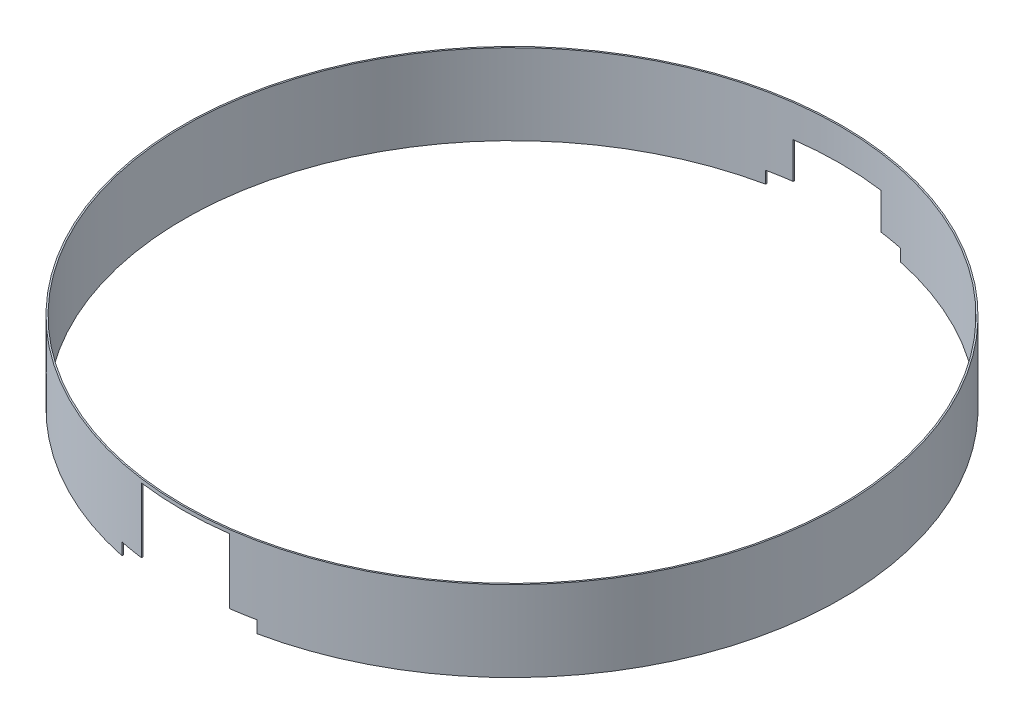
ISO-10303-21;
HEADER;
FILE_DESCRIPTION(('STEP AP214'),'2;1');
FILE_NAME('part.step','',(''),(''),'','','');
FILE_SCHEMA(('AUTOMOTIVE_DESIGN { 1 0 10303 214 1 1 1 1 }'));
ENDSEC;
DATA;
#1=APPLICATION_CONTEXT('core data for automotive mechanical design processes');
#2=APPLICATION_PROTOCOL_DEFINITION('international standard','automotive_design',2000,#1);
#3=PRODUCT_CONTEXT('',#1,'mechanical');
#4=PRODUCT('Part','Part','',(#3));
#5=PRODUCT_RELATED_PRODUCT_CATEGORY('part','',(#4));
#6=PRODUCT_DEFINITION_FORMATION('','',#4);
#7=PRODUCT_DEFINITION_CONTEXT('part definition',#1,'design');
#8=PRODUCT_DEFINITION('design','',#6,#7);
#9=PRODUCT_DEFINITION_SHAPE('','',#8);
#10=(LENGTH_UNIT() NAMED_UNIT(*) SI_UNIT(.MILLI.,.METRE.));
#11=(NAMED_UNIT(*) PLANE_ANGLE_UNIT() SI_UNIT($,.RADIAN.));
#12=(NAMED_UNIT(*) SI_UNIT($,.STERADIAN.) SOLID_ANGLE_UNIT());
#13=UNCERTAINTY_MEASURE_WITH_UNIT(LENGTH_MEASURE(1.E-05),#10,'distance_accuracy_value','');
#14=(GEOMETRIC_REPRESENTATION_CONTEXT(3) GLOBAL_UNCERTAINTY_ASSIGNED_CONTEXT((#13)) GLOBAL_UNIT_ASSIGNED_CONTEXT((#10,
#11,#12)) REPRESENTATION_CONTEXT('',''));
#15=CARTESIAN_POINT('',(0.,0.,0.));
#16=DIRECTION('',(0.,0.,1.));
#17=DIRECTION('',(1.,0.,0.));
#18=AXIS2_PLACEMENT_3D('',#15,#16,#17);
#19=CARTESIAN_POINT('',(0.,0.,0.));
#20=DIRECTION('',(0.,1.,0.));
#21=DIRECTION('',(0.,0.,1.));
#22=AXIS2_PLACEMENT_3D('',#19,#20,#21);
#23=PLANE('',#22);
#24=DIRECTION('',(0.,0.,1.));
#25=VECTOR('',#24,1.);
#26=CARTESIAN_POINT('',(-92.,0.,-500.));
#27=LINE('',#26,#25);
#28=CARTESIAN_POINT('',(-92.,0.,-440.495175910021));
#29=VERTEX_POINT('',#28);
#30=CARTESIAN_POINT('',(-92.,0.,-438.451821754683));
#31=VERTEX_POINT('',#30);
#32=EDGE_CURVE('E282',#29,#31,#27,.T.);
#33=ORIENTED_EDGE('',*,*,#32,.T.);
#34=CARTESIAN_POINT('',(0.,0.,0.));
#35=DIRECTION('',(0.,1.,0.));
#36=DIRECTION('',(0.,0.,1.));
#37=AXIS2_PLACEMENT_3D('',#34,#35,#36);
#38=CIRCLE('',#37,448.);
#39=CARTESIAN_POINT('',(-92.,0.,438.451821754683));
#40=VERTEX_POINT('',#39);
#41=EDGE_CURVE('E214',#31,#40,#38,.T.);
#42=ORIENTED_EDGE('',*,*,#41,.T.);
#43=DIRECTION('',(0.,0.,-1.));
#44=VECTOR('',#43,1.);
#45=CARTESIAN_POINT('',(-92.,0.,500.));
#46=LINE('',#45,#44);
#47=CARTESIAN_POINT('',(-92.,0.,440.495175910021));
#48=VERTEX_POINT('',#47);
#49=EDGE_CURVE('E178',#48,#40,#46,.T.);
#50=ORIENTED_EDGE('',*,*,#49,.F.);
#51=CARTESIAN_POINT('',(0.,0.,0.));
#52=DIRECTION('',(0.,1.,0.));
#53=DIRECTION('',(0.,0.,1.));
#54=AXIS2_PLACEMENT_3D('',#51,#52,#53);
#55=CIRCLE('',#54,450.);
#56=EDGE_CURVE('E218',#29,#48,#55,.T.);
#57=ORIENTED_EDGE('',*,*,#56,.F.);
#58=EDGE_LOOP('',(#33,#42,#50,#57));
#59=FACE_BOUND('',#58,.T.);
#60=ADVANCED_FACE('F35',(#59),#23,.F.);
#61=CARTESIAN_POINT('',(92.,0.,438.451821754683));
#62=VERTEX_POINT('',#61);
#63=CARTESIAN_POINT('',(92.,0.,-438.451821754683));
#64=VERTEX_POINT('',#63);
#65=EDGE_CURVE('E219',#62,#64,#38,.T.);
#66=ORIENTED_EDGE('',*,*,#65,.T.);
#67=DIRECTION('',(0.,0.,1.));
#68=VECTOR('',#67,1.);
#69=CARTESIAN_POINT('',(92.,0.,-500.));
#70=LINE('',#69,#68);
#71=CARTESIAN_POINT('',(92.,0.,-440.495175910021));
#72=VERTEX_POINT('',#71);
#73=EDGE_CURVE('E277',#72,#64,#70,.T.);
#74=ORIENTED_EDGE('',*,*,#73,.F.);
#75=CARTESIAN_POINT('',(92.,0.,440.495175910021));
#76=VERTEX_POINT('',#75);
#77=EDGE_CURVE('E226',#76,#72,#55,.T.);
#78=ORIENTED_EDGE('',*,*,#77,.F.);
#79=DIRECTION('',(0.,0.,-1.));
#80=VECTOR('',#79,1.);
#81=CARTESIAN_POINT('',(92.,0.,500.));
#82=LINE('',#81,#80);
#83=EDGE_CURVE('E172',#76,#62,#82,.T.);
#84=ORIENTED_EDGE('',*,*,#83,.T.);
#85=EDGE_LOOP('',(#66,#74,#78,#84));
#86=FACE_BOUND('',#85,.T.);
#87=ADVANCED_FACE('F296',(#86),#23,.F.);
#88=CARTESIAN_POINT('',(0.,110.,0.));
#89=DIRECTION('',(0.,1.,0.));
#90=DIRECTION('',(0.,0.,1.));
#91=AXIS2_PLACEMENT_3D('',#88,#89,#90);
#92=PLANE('',#91);
#93=CARTESIAN_POINT('',(0.,110.,0.));
#94=DIRECTION('',(0.,1.,0.));
#95=DIRECTION('',(0.,0.,1.));
#96=AXIS2_PLACEMENT_3D('',#93,#94,#95);
#97=CIRCLE('',#96,450.);
#98=CARTESIAN_POINT('',(0.,110.,450.));
#99=VERTEX_POINT('',#98);
#100=EDGE_CURVE('E222',#99,#99,#97,.T.);
#101=ORIENTED_EDGE('',*,*,#100,.T.);
#102=EDGE_LOOP('',(#101));
#103=FACE_BOUND('',#102,.T.);
#104=CARTESIAN_POINT('',(0.,110.,0.));
#105=DIRECTION('',(0.,1.,0.));
#106=DIRECTION('',(0.,0.,1.));
#107=AXIS2_PLACEMENT_3D('',#104,#105,#106);
#108=CIRCLE('',#107,448.);
#109=CARTESIAN_POINT('',(0.,110.,448.));
#110=VERTEX_POINT('',#109);
#111=EDGE_CURVE('E215',#110,#110,#108,.T.);
#112=ORIENTED_EDGE('',*,*,#111,.F.);
#113=EDGE_LOOP('',(#112));
#114=FACE_BOUND('',#113,.T.);
#115=ADVANCED_FACE('F343',(#103,#114),#92,.T.);
#116=CARTESIAN_POINT('',(0.,110.,0.));
#117=DIRECTION('',(0.,-1.,0.));
#118=DIRECTION('',(0.,0.,-1.));
#119=AXIS2_PLACEMENT_3D('',#116,#117,#118);
#120=CYLINDRICAL_SURFACE('',#119,450.);
#121=ORIENTED_EDGE('',*,*,#100,.F.);
#122=EDGE_LOOP('',(#121));
#123=FACE_BOUND('',#122,.T.);
#124=ORIENTED_EDGE('',*,*,#77,.T.);
#125=DIRECTION('',(0.,-1.,0.));
#126=VECTOR('',#125,1.);
#127=CARTESIAN_POINT('',(92.,110.,-440.495175910021));
#128=LINE('',#127,#126);
#129=CARTESIAN_POINT('',(92.,16.5,-440.495175910021));
#130=VERTEX_POINT('',#129);
#131=EDGE_CURVE('E287',#72,#130,#128,.F.);
#132=ORIENTED_EDGE('',*,*,#131,.T.);
#133=CARTESIAN_POINT('',(0.,16.5000000000001,0.));
#134=DIRECTION('',(0.,-1.,0.));
#135=DIRECTION('',(1.,0.,0.));
#136=AXIS2_PLACEMENT_3D('',#133,#134,#135);
#137=CIRCLE('',#136,450.);
#138=CARTESIAN_POINT('',(60.,16.5,-445.982062419555));
#139=VERTEX_POINT('',#138);
#140=EDGE_CURVE('E290',#139,#130,#137,.T.);
#141=ORIENTED_EDGE('',*,*,#140,.F.);
#142=DIRECTION('',(0.,-1.,0.));
#143=VECTOR('',#142,1.);
#144=CARTESIAN_POINT('',(60.,110.,-445.982062419555));
#145=LINE('',#144,#143);
#146=CARTESIAN_POINT('',(60.,66.0000000000001,-445.982062419555));
#147=VERTEX_POINT('',#146);
#148=EDGE_CURVE('E174',#139,#147,#145,.F.);
#149=ORIENTED_EDGE('',*,*,#148,.T.);
#150=CARTESIAN_POINT('',(0.,66.0000000000001,0.));
#151=DIRECTION('',(0.,1.,0.));
#152=DIRECTION('',(-1.,0.,0.));
#153=AXIS2_PLACEMENT_3D('',#150,#151,#152);
#154=CIRCLE('',#153,450.);
#155=CARTESIAN_POINT('',(-60.,66.0000000000001,-445.982062419555));
#156=VERTEX_POINT('',#155);
#157=EDGE_CURVE('E168',#147,#156,#154,.T.);
#158=ORIENTED_EDGE('',*,*,#157,.T.);
#159=DIRECTION('',(0.,-1.,0.));
#160=VECTOR('',#159,1.);
#161=CARTESIAN_POINT('',(-60.,110.,-445.982062419555));
#162=LINE('',#161,#160);
#163=CARTESIAN_POINT('',(-60.,16.5,-445.982062419555));
#164=VERTEX_POINT('',#163);
#165=EDGE_CURVE('E159',#164,#156,#162,.F.);
#166=ORIENTED_EDGE('',*,*,#165,.F.);
#167=CARTESIAN_POINT('',(0.,16.5,0.));
#168=DIRECTION('',(0.,1.,0.));
#169=DIRECTION('',(-1.,0.,0.));
#170=AXIS2_PLACEMENT_3D('',#167,#168,#169);
#171=CIRCLE('',#170,450.);
#172=CARTESIAN_POINT('',(-92.,16.5,-440.495175910021));
#173=VERTEX_POINT('',#172);
#174=EDGE_CURVE('E146',#164,#173,#171,.T.);
#175=ORIENTED_EDGE('',*,*,#174,.T.);
#176=DIRECTION('',(0.,-1.,0.));
#177=VECTOR('',#176,1.);
#178=CARTESIAN_POINT('',(-92.,110.,-440.495175910021));
#179=LINE('',#178,#177);
#180=EDGE_CURVE('E153',#29,#173,#179,.F.);
#181=ORIENTED_EDGE('',*,*,#180,.F.);
#182=ORIENTED_EDGE('',*,*,#56,.T.);
#183=DIRECTION('',(0.,-1.,0.));
#184=VECTOR('',#183,1.);
#185=CARTESIAN_POINT('',(-92.,110.,440.495175910021));
#186=LINE('',#185,#184);
#187=CARTESIAN_POINT('',(-92.,16.5,440.495175910021));
#188=VERTEX_POINT('',#187);
#189=EDGE_CURVE('E211',#48,#188,#186,.F.);
#190=ORIENTED_EDGE('',*,*,#189,.T.);
#191=CARTESIAN_POINT('',(0.,16.5,0.));
#192=DIRECTION('',(0.,-1.,0.));
#193=DIRECTION('',(1.,0.,0.));
#194=AXIS2_PLACEMENT_3D('',#191,#192,#193);
#195=CIRCLE('',#194,450.);
#196=CARTESIAN_POINT('',(-60.,16.5,445.982062419555));
#197=VERTEX_POINT('',#196);
#198=EDGE_CURVE('E209',#197,#188,#195,.T.);
#199=ORIENTED_EDGE('',*,*,#198,.F.);
#200=DIRECTION('',(0.,-1.,0.));
#201=VECTOR('',#200,1.);
#202=CARTESIAN_POINT('',(-60.,110.,445.982062419555));
#203=LINE('',#202,#201);
#204=CARTESIAN_POINT('',(-60.,105.,445.982062419555));
#205=VERTEX_POINT('',#204);
#206=EDGE_CURVE('E207',#205,#197,#203,.T.);
#207=ORIENTED_EDGE('',*,*,#206,.F.);
#208=CARTESIAN_POINT('',(0.,105.,0.));
#209=DIRECTION('',(0.,1.,0.));
#210=DIRECTION('',(0.,0.,1.));
#211=AXIS2_PLACEMENT_3D('',#208,#209,#210);
#212=CIRCLE('',#211,450.);
#213=CARTESIAN_POINT('',(60.,105.,445.982062419555));
#214=VERTEX_POINT('',#213);
#215=EDGE_CURVE('E204',#205,#214,#212,.T.);
#216=ORIENTED_EDGE('',*,*,#215,.T.);
#217=DIRECTION('',(0.,-1.,0.));
#218=VECTOR('',#217,1.);
#219=CARTESIAN_POINT('',(60.,110.,445.982062419555));
#220=LINE('',#219,#218);
#221=CARTESIAN_POINT('',(60.,16.5,445.982062419555));
#222=VERTEX_POINT('',#221);
#223=EDGE_CURVE('E201',#214,#222,#220,.T.);
#224=ORIENTED_EDGE('',*,*,#223,.T.);
#225=CARTESIAN_POINT('',(0.,16.5,0.));
#226=DIRECTION('',(0.,1.,0.));
#227=DIRECTION('',(0.,0.,1.));
#228=AXIS2_PLACEMENT_3D('',#225,#226,#227);
#229=CIRCLE('',#228,450.);
#230=CARTESIAN_POINT('',(92.,16.5,440.495175910021));
#231=VERTEX_POINT('',#230);
#232=EDGE_CURVE('E193',#222,#231,#229,.T.);
#233=ORIENTED_EDGE('',*,*,#232,.T.);
#234=DIRECTION('',(0.,-1.,0.));
#235=VECTOR('',#234,1.);
#236=CARTESIAN_POINT('',(92.,110.,440.495175910021));
#237=LINE('',#236,#235);
#238=EDGE_CURVE('E199',#76,#231,#237,.F.);
#239=ORIENTED_EDGE('',*,*,#238,.F.);
#240=EDGE_LOOP('',(#124,#132,#141,#149,#158,#166,#175,#181,#182,#190,#199,#207,#216,#224,#233,#239));
#241=FACE_BOUND('',#240,.T.);
#242=ADVANCED_FACE('F37',(#123,#241),#120,.T.);
#243=CARTESIAN_POINT('',(0.,110.,0.));
#244=DIRECTION('',(0.,-1.,0.));
#245=DIRECTION('',(0.,0.,-1.));
#246=AXIS2_PLACEMENT_3D('',#243,#244,#245);
#247=CYLINDRICAL_SURFACE('',#246,448.);
#248=DIRECTION('',(0.,-1.,0.));
#249=VECTOR('',#248,1.);
#250=CARTESIAN_POINT('',(92.,110.,-438.451821754683));
#251=LINE('',#250,#249);
#252=CARTESIAN_POINT('',(92.,16.5,-438.451821754683));
#253=VERTEX_POINT('',#252);
#254=EDGE_CURVE('E11',#64,#253,#251,.F.);
#255=ORIENTED_EDGE('',*,*,#254,.F.);
#256=ORIENTED_EDGE('',*,*,#65,.F.);
#257=DIRECTION('',(0.,-1.,0.));
#258=VECTOR('',#257,1.);
#259=CARTESIAN_POINT('',(92.,110.,438.451821754683));
#260=LINE('',#259,#258);
#261=CARTESIAN_POINT('',(92.,16.5,438.451821754683));
#262=VERTEX_POINT('',#261);
#263=EDGE_CURVE('E229',#62,#262,#260,.F.);
#264=ORIENTED_EDGE('',*,*,#263,.T.);
#265=CARTESIAN_POINT('',(0.,16.5,0.));
#266=DIRECTION('',(0.,1.,0.));
#267=DIRECTION('',(0.,0.,1.));
#268=AXIS2_PLACEMENT_3D('',#265,#266,#267);
#269=CIRCLE('',#268,448.);
#270=CARTESIAN_POINT('',(60.,16.5,443.963962501463));
#271=VERTEX_POINT('',#270);
#272=EDGE_CURVE('E225',#271,#262,#269,.T.);
#273=ORIENTED_EDGE('',*,*,#272,.F.);
#274=DIRECTION('',(0.,-1.,0.));
#275=VECTOR('',#274,1.);
#276=CARTESIAN_POINT('',(60.,110.,443.963962501463));
#277=LINE('',#276,#275);
#278=CARTESIAN_POINT('',(60.,105.,443.963962501463));
#279=VERTEX_POINT('',#278);
#280=EDGE_CURVE('E232',#279,#271,#277,.T.);
#281=ORIENTED_EDGE('',*,*,#280,.F.);
#282=CARTESIAN_POINT('',(0.,105.,0.));
#283=DIRECTION('',(0.,1.,0.));
#284=DIRECTION('',(0.,0.,1.));
#285=AXIS2_PLACEMENT_3D('',#282,#283,#284);
#286=CIRCLE('',#285,448.);
#287=CARTESIAN_POINT('',(-60.,105.,443.963962501463));
#288=VERTEX_POINT('',#287);
#289=EDGE_CURVE('E234',#288,#279,#286,.T.);
#290=ORIENTED_EDGE('',*,*,#289,.F.);
#291=DIRECTION('',(0.,-1.,0.));
#292=VECTOR('',#291,1.);
#293=CARTESIAN_POINT('',(-60.,110.,443.963962501463));
#294=LINE('',#293,#292);
#295=CARTESIAN_POINT('',(-60.,16.5,443.963962501463));
#296=VERTEX_POINT('',#295);
#297=EDGE_CURVE('E236',#288,#296,#294,.T.);
#298=ORIENTED_EDGE('',*,*,#297,.T.);
#299=CARTESIAN_POINT('',(0.,16.5,0.));
#300=DIRECTION('',(0.,-1.,0.));
#301=DIRECTION('',(1.,0.,0.));
#302=AXIS2_PLACEMENT_3D('',#299,#300,#301);
#303=CIRCLE('',#302,448.);
#304=CARTESIAN_POINT('',(-92.,16.5,438.451821754683));
#305=VERTEX_POINT('',#304);
#306=EDGE_CURVE('E239',#296,#305,#303,.T.);
#307=ORIENTED_EDGE('',*,*,#306,.T.);
#308=DIRECTION('',(0.,-1.,0.));
#309=VECTOR('',#308,1.);
#310=CARTESIAN_POINT('',(-92.,110.,438.451821754683));
#311=LINE('',#310,#309);
#312=EDGE_CURVE('E242',#40,#305,#311,.F.);
#313=ORIENTED_EDGE('',*,*,#312,.F.);
#314=ORIENTED_EDGE('',*,*,#41,.F.);
#315=DIRECTION('',(0.,-1.,0.));
#316=VECTOR('',#315,1.);
#317=CARTESIAN_POINT('',(-92.,110.,-438.451821754683));
#318=LINE('',#317,#316);
#319=CARTESIAN_POINT('',(-92.,16.5,-438.451821754683));
#320=VERTEX_POINT('',#319);
#321=EDGE_CURVE('E246',#31,#320,#318,.F.);
#322=ORIENTED_EDGE('',*,*,#321,.T.);
#323=CARTESIAN_POINT('',(0.,16.5,0.));
#324=DIRECTION('',(0.,1.,0.));
#325=DIRECTION('',(-1.,0.,0.));
#326=AXIS2_PLACEMENT_3D('',#323,#324,#325);
#327=CIRCLE('',#326,448.);
#328=CARTESIAN_POINT('',(-60.,16.5,-443.963962501463));
#329=VERTEX_POINT('',#328);
#330=EDGE_CURVE('E244',#329,#320,#327,.T.);
#331=ORIENTED_EDGE('',*,*,#330,.F.);
#332=DIRECTION('',(0.,-1.,0.));
#333=VECTOR('',#332,1.);
#334=CARTESIAN_POINT('',(-60.,110.,-443.963962501463));
#335=LINE('',#334,#333);
#336=CARTESIAN_POINT('',(-60.,66.0000000000001,-443.963962501463));
#337=VERTEX_POINT('',#336);
#338=EDGE_CURVE('E162',#329,#337,#335,.F.);
#339=ORIENTED_EDGE('',*,*,#338,.T.);
#340=CARTESIAN_POINT('',(0.,66.0000000000001,0.));
#341=DIRECTION('',(0.,1.,0.));
#342=DIRECTION('',(-1.,0.,0.));
#343=AXIS2_PLACEMENT_3D('',#340,#341,#342);
#344=CIRCLE('',#343,448.);
#345=CARTESIAN_POINT('',(60.,66.0000000000001,-443.963962501463));
#346=VERTEX_POINT('',#345);
#347=EDGE_CURVE('E250',#346,#337,#344,.T.);
#348=ORIENTED_EDGE('',*,*,#347,.F.);
#349=DIRECTION('',(0.,-1.,0.));
#350=VECTOR('',#349,1.);
#351=CARTESIAN_POINT('',(60.,110.,-443.963962501463));
#352=LINE('',#351,#350);
#353=CARTESIAN_POINT('',(60.,16.5,-443.963962501463));
#354=VERTEX_POINT('',#353);
#355=EDGE_CURVE('E252',#354,#346,#352,.F.);
#356=ORIENTED_EDGE('',*,*,#355,.F.);
#357=CARTESIAN_POINT('',(0.,16.5000000000001,0.));
#358=DIRECTION('',(0.,-1.,0.));
#359=DIRECTION('',(1.,0.,0.));
#360=AXIS2_PLACEMENT_3D('',#357,#358,#359);
#361=CIRCLE('',#360,448.);
#362=EDGE_CURVE('E43',#354,#253,#361,.T.);
#363=ORIENTED_EDGE('',*,*,#362,.T.);
#364=EDGE_LOOP('',(#255,#256,#264,#273,#281,#290,#298,#307,#313,#314,#322,#331,#339,#348,#356,#363));
#365=FACE_BOUND('',#364,.T.);
#366=ORIENTED_EDGE('',*,*,#111,.T.);
#367=EDGE_LOOP('',(#366));
#368=FACE_BOUND('',#367,.T.);
#369=ADVANCED_FACE('F257',(#365,#368),#247,.F.);
#370=CARTESIAN_POINT('',(-92.,0.,500.));
#371=DIRECTION('',(-1.,0.,0.));
#372=DIRECTION('',(0.,0.,1.));
#373=AXIS2_PLACEMENT_3D('',#370,#371,#372);
#374=PLANE('',#373);
#375=ORIENTED_EDGE('',*,*,#49,.T.);
#376=ORIENTED_EDGE('',*,*,#312,.T.);
#377=DIRECTION('',(0.,0.,-1.));
#378=VECTOR('',#377,1.);
#379=CARTESIAN_POINT('',(-92.,16.5,500.));
#380=LINE('',#379,#378);
#381=EDGE_CURVE('E181',#188,#305,#380,.T.);
#382=ORIENTED_EDGE('',*,*,#381,.F.);
#383=ORIENTED_EDGE('',*,*,#189,.F.);
#384=EDGE_LOOP('',(#375,#376,#382,#383));
#385=FACE_BOUND('',#384,.T.);
#386=ADVANCED_FACE('F322',(#385),#374,.F.);
#387=CARTESIAN_POINT('',(0.,16.5,500.));
#388=DIRECTION('',(0.,-1.,0.));
#389=DIRECTION('',(1.,0.,0.));
#390=AXIS2_PLACEMENT_3D('',#387,#388,#389);
#391=PLANE('',#390);
#392=ORIENTED_EDGE('',*,*,#198,.T.);
#393=ORIENTED_EDGE('',*,*,#381,.T.);
#394=ORIENTED_EDGE('',*,*,#306,.F.);
#395=DIRECTION('',(0.,0.,-1.));
#396=VECTOR('',#395,1.);
#397=CARTESIAN_POINT('',(-60.,16.5,500.));
#398=LINE('',#397,#396);
#399=EDGE_CURVE('E184',#197,#296,#398,.T.);
#400=ORIENTED_EDGE('',*,*,#399,.F.);
#401=EDGE_LOOP('',(#392,#393,#394,#400));
#402=FACE_BOUND('',#401,.T.);
#403=ADVANCED_FACE('F317',(#402),#391,.T.);
#404=CARTESIAN_POINT('',(-60.,0.,500.));
#405=DIRECTION('',(1.,0.,0.));
#406=DIRECTION('',(0.,1.,0.));
#407=AXIS2_PLACEMENT_3D('',#404,#405,#406);
#408=PLANE('',#407);
#409=ORIENTED_EDGE('',*,*,#206,.T.);
#410=ORIENTED_EDGE('',*,*,#399,.T.);
#411=ORIENTED_EDGE('',*,*,#297,.F.);
#412=DIRECTION('',(0.,0.,-1.));
#413=VECTOR('',#412,1.);
#414=CARTESIAN_POINT('',(-60.,105.,500.));
#415=LINE('',#414,#413);
#416=EDGE_CURVE('E187',#205,#288,#415,.T.);
#417=ORIENTED_EDGE('',*,*,#416,.F.);
#418=EDGE_LOOP('',(#409,#410,#411,#417));
#419=FACE_BOUND('',#418,.T.);
#420=ADVANCED_FACE('F315',(#419),#408,.T.);
#421=CARTESIAN_POINT('',(0.,105.,500.));
#422=DIRECTION('',(0.,1.,0.));
#423=DIRECTION('',(0.,0.,1.));
#424=AXIS2_PLACEMENT_3D('',#421,#422,#423);
#425=PLANE('',#424);
#426=ORIENTED_EDGE('',*,*,#416,.T.);
#427=ORIENTED_EDGE('',*,*,#289,.T.);
#428=DIRECTION('',(0.,0.,-1.));
#429=VECTOR('',#428,1.);
#430=CARTESIAN_POINT('',(60.,105.,500.));
#431=LINE('',#430,#429);
#432=EDGE_CURVE('E190',#214,#279,#431,.T.);
#433=ORIENTED_EDGE('',*,*,#432,.F.);
#434=ORIENTED_EDGE('',*,*,#215,.F.);
#435=EDGE_LOOP('',(#426,#427,#433,#434));
#436=FACE_BOUND('',#435,.T.);
#437=ADVANCED_FACE('F309',(#436),#425,.F.);
#438=CARTESIAN_POINT('',(60.,0.,500.));
#439=DIRECTION('',(1.,0.,0.));
#440=DIRECTION('',(0.,0.,-1.));
#441=AXIS2_PLACEMENT_3D('',#438,#439,#440);
#442=PLANE('',#441);
#443=ORIENTED_EDGE('',*,*,#432,.T.);
#444=ORIENTED_EDGE('',*,*,#280,.T.);
#445=DIRECTION('',(0.,0.,-1.));
#446=VECTOR('',#445,1.);
#447=CARTESIAN_POINT('',(60.,16.5,500.));
#448=LINE('',#447,#446);
#449=EDGE_CURVE('E58',#222,#271,#448,.T.);
#450=ORIENTED_EDGE('',*,*,#449,.F.);
#451=ORIENTED_EDGE('',*,*,#223,.F.);
#452=EDGE_LOOP('',(#443,#444,#450,#451));
#453=FACE_BOUND('',#452,.T.);
#454=ADVANCED_FACE('F306',(#453),#442,.F.);
#455=CARTESIAN_POINT('',(92.,0.,500.));
#456=DIRECTION('',(-1.,0.,0.));
#457=DIRECTION('',(0.,0.,1.));
#458=AXIS2_PLACEMENT_3D('',#455,#456,#457);
#459=PLANE('',#458);
#460=ORIENTED_EDGE('',*,*,#238,.T.);
#461=DIRECTION('',(0.,0.,-1.));
#462=VECTOR('',#461,1.);
#463=CARTESIAN_POINT('',(92.,16.5,500.));
#464=LINE('',#463,#462);
#465=EDGE_CURVE('E169',#231,#262,#464,.T.);
#466=ORIENTED_EDGE('',*,*,#465,.T.);
#467=ORIENTED_EDGE('',*,*,#263,.F.);
#468=ORIENTED_EDGE('',*,*,#83,.F.);
#469=EDGE_LOOP('',(#460,#466,#467,#468));
#470=FACE_BOUND('',#469,.T.);
#471=ADVANCED_FACE('F300',(#470),#459,.T.);
#472=CARTESIAN_POINT('',(60.,16.5,500.));
#473=DIRECTION('',(0.,1.,0.));
#474=DIRECTION('',(0.,0.,1.));
#475=AXIS2_PLACEMENT_3D('',#472,#473,#474);
#476=PLANE('',#475);
#477=ORIENTED_EDGE('',*,*,#449,.T.);
#478=ORIENTED_EDGE('',*,*,#272,.T.);
#479=ORIENTED_EDGE('',*,*,#465,.F.);
#480=ORIENTED_EDGE('',*,*,#232,.F.);
#481=EDGE_LOOP('',(#477,#478,#479,#480));
#482=FACE_BOUND('',#481,.T.);
#483=ADVANCED_FACE('F301',(#482),#476,.F.);
#484=CARTESIAN_POINT('',(-60.,0.,-500.));
#485=DIRECTION('',(1.,0.,0.));
#486=DIRECTION('',(0.,1.,0.));
#487=AXIS2_PLACEMENT_3D('',#484,#485,#486);
#488=PLANE('',#487);
#489=ORIENTED_EDGE('',*,*,#165,.T.);
#490=DIRECTION('',(0.,0.,1.));
#491=VECTOR('',#490,1.);
#492=CARTESIAN_POINT('',(-60.,66.0000000000001,-500.));
#493=LINE('',#492,#491);
#494=EDGE_CURVE('E154',#156,#337,#493,.T.);
#495=ORIENTED_EDGE('',*,*,#494,.T.);
#496=ORIENTED_EDGE('',*,*,#338,.F.);
#497=DIRECTION('',(0.,0.,1.));
#498=VECTOR('',#497,1.);
#499=CARTESIAN_POINT('',(-60.,16.5,-500.));
#500=LINE('',#499,#498);
#501=EDGE_CURVE('E50',#164,#329,#500,.T.);
#502=ORIENTED_EDGE('',*,*,#501,.F.);
#503=EDGE_LOOP('',(#489,#495,#496,#502));
#504=FACE_BOUND('',#503,.T.);
#505=ADVANCED_FACE('F157',(#504),#488,.T.);
#506=CARTESIAN_POINT('',(0.,66.0000000000001,-500.));
#507=DIRECTION('',(0.,1.,0.));
#508=DIRECTION('',(-1.,0.,0.));
#509=AXIS2_PLACEMENT_3D('',#506,#507,#508);
#510=PLANE('',#509);
#511=DIRECTION('',(0.,0.,1.));
#512=VECTOR('',#511,1.);
#513=CARTESIAN_POINT('',(60.,66.0000000000001,-500.));
#514=LINE('',#513,#512);
#515=EDGE_CURVE('E274',#147,#346,#514,.T.);
#516=ORIENTED_EDGE('',*,*,#515,.T.);
#517=ORIENTED_EDGE('',*,*,#347,.T.);
#518=ORIENTED_EDGE('',*,*,#494,.F.);
#519=ORIENTED_EDGE('',*,*,#157,.F.);
#520=EDGE_LOOP('',(#516,#517,#518,#519));
#521=FACE_BOUND('',#520,.T.);
#522=ADVANCED_FACE('F330',(#521),#510,.F.);
#523=CARTESIAN_POINT('',(60.,0.,-500.));
#524=DIRECTION('',(1.,0.,0.));
#525=DIRECTION('',(0.,0.,-1.));
#526=AXIS2_PLACEMENT_3D('',#523,#524,#525);
#527=PLANE('',#526);
#528=DIRECTION('',(0.,0.,1.));
#529=VECTOR('',#528,1.);
#530=CARTESIAN_POINT('',(60.,16.5,-500.));
#531=LINE('',#530,#529);
#532=EDGE_CURVE('E266',#139,#354,#531,.T.);
#533=ORIENTED_EDGE('',*,*,#532,.T.);
#534=ORIENTED_EDGE('',*,*,#355,.T.);
#535=ORIENTED_EDGE('',*,*,#515,.F.);
#536=ORIENTED_EDGE('',*,*,#148,.F.);
#537=EDGE_LOOP('',(#533,#534,#535,#536));
#538=FACE_BOUND('',#537,.T.);
#539=ADVANCED_FACE('F271',(#538),#527,.F.);
#540=CARTESIAN_POINT('',(0.,16.5000000000001,-500.));
#541=DIRECTION('',(0.,-1.,0.));
#542=DIRECTION('',(1.,0.,0.));
#543=AXIS2_PLACEMENT_3D('',#540,#541,#542);
#544=PLANE('',#543);
#545=ORIENTED_EDGE('',*,*,#140,.T.);
#546=DIRECTION('',(0.,0.,1.));
#547=VECTOR('',#546,1.);
#548=CARTESIAN_POINT('',(92.,16.5,-500.));
#549=LINE('',#548,#547);
#550=EDGE_CURVE('E269',#130,#253,#549,.T.);
#551=ORIENTED_EDGE('',*,*,#550,.T.);
#552=ORIENTED_EDGE('',*,*,#362,.F.);
#553=ORIENTED_EDGE('',*,*,#532,.F.);
#554=EDGE_LOOP('',(#545,#551,#552,#553));
#555=FACE_BOUND('',#554,.T.);
#556=ADVANCED_FACE('F265',(#555),#544,.T.);
#557=CARTESIAN_POINT('',(92.,0.,-500.));
#558=DIRECTION('',(1.,0.,0.));
#559=DIRECTION('',(0.,0.,-1.));
#560=AXIS2_PLACEMENT_3D('',#557,#558,#559);
#561=PLANE('',#560);
#562=ORIENTED_EDGE('',*,*,#73,.T.);
#563=ORIENTED_EDGE('',*,*,#254,.T.);
#564=ORIENTED_EDGE('',*,*,#550,.F.);
#565=ORIENTED_EDGE('',*,*,#131,.F.);
#566=EDGE_LOOP('',(#562,#563,#564,#565));
#567=FACE_BOUND('',#566,.T.);
#568=ADVANCED_FACE('F292',(#567),#561,.F.);
#569=CARTESIAN_POINT('',(-92.,0.,-500.));
#570=DIRECTION('',(1.,0.,0.));
#571=DIRECTION('',(0.,0.,-1.));
#572=AXIS2_PLACEMENT_3D('',#569,#570,#571);
#573=PLANE('',#572);
#574=ORIENTED_EDGE('',*,*,#180,.T.);
#575=DIRECTION('',(0.,0.,1.));
#576=VECTOR('',#575,1.);
#577=CARTESIAN_POINT('',(-92.,16.5,-500.));
#578=LINE('',#577,#576);
#579=EDGE_CURVE('E149',#173,#320,#578,.T.);
#580=ORIENTED_EDGE('',*,*,#579,.T.);
#581=ORIENTED_EDGE('',*,*,#321,.F.);
#582=ORIENTED_EDGE('',*,*,#32,.F.);
#583=EDGE_LOOP('',(#574,#580,#581,#582));
#584=FACE_BOUND('',#583,.T.);
#585=ADVANCED_FACE('F328',(#584),#573,.T.);
#586=CARTESIAN_POINT('',(0.,16.5,-500.));
#587=DIRECTION('',(0.,1.,0.));
#588=DIRECTION('',(-1.,0.,0.));
#589=AXIS2_PLACEMENT_3D('',#586,#587,#588);
#590=PLANE('',#589);
#591=ORIENTED_EDGE('',*,*,#501,.T.);
#592=ORIENTED_EDGE('',*,*,#330,.T.);
#593=ORIENTED_EDGE('',*,*,#579,.F.);
#594=ORIENTED_EDGE('',*,*,#174,.F.);
#595=EDGE_LOOP('',(#591,#592,#593,#594));
#596=FACE_BOUND('',#595,.T.);
#597=ADVANCED_FACE('F147',(#596),#590,.F.);
#598=CLOSED_SHELL('',(#60,#87,#115,#242,#369,#386,#403,#420,#437,#454,#471,#483,#505,#522,#539,
#556,#568,#585,#597));
#599=MANIFOLD_SOLID_BREP('B2',#598);
#600=ADVANCED_BREP_SHAPE_REPRESENTATION('',(#18,#599),#14);
#601=SHAPE_DEFINITION_REPRESENTATION(#9,#600);
ENDSEC;
END-ISO-10303-21;
